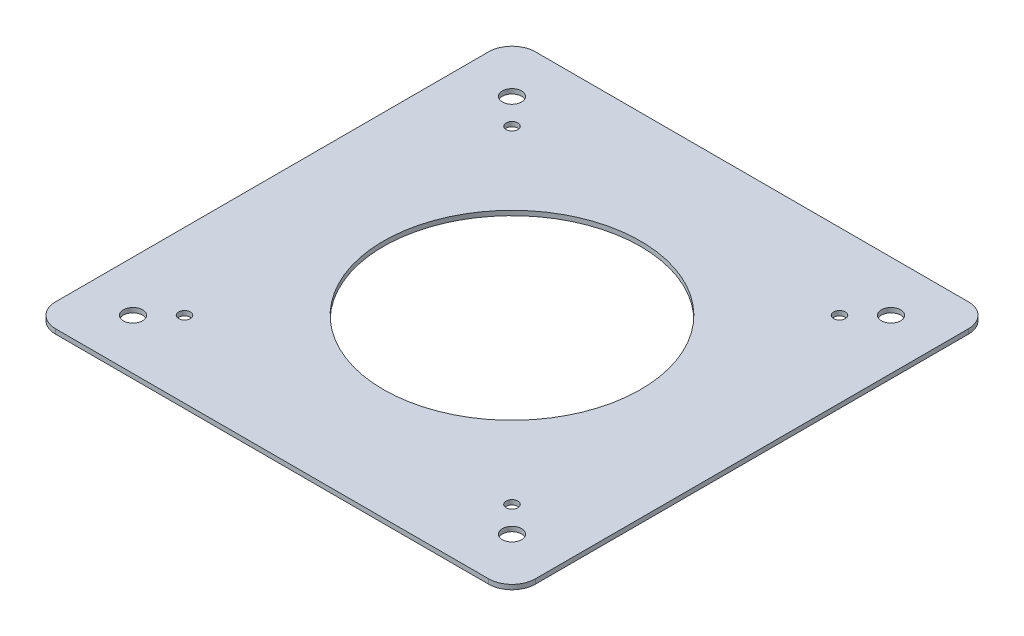
ISO-10303-21;
HEADER;
FILE_DESCRIPTION(('STEP AP214'),'2;1');
FILE_NAME('part.step','',(''),(''),'','','');
FILE_SCHEMA(('AUTOMOTIVE_DESIGN { 1 0 10303 214 1 1 1 1 }'));
ENDSEC;
DATA;
#1=APPLICATION_CONTEXT('core data for automotive mechanical design processes');
#2=APPLICATION_PROTOCOL_DEFINITION('international standard','automotive_design',2000,#1);
#3=PRODUCT_CONTEXT('',#1,'mechanical');
#4=PRODUCT('Part','Part','',(#3));
#5=PRODUCT_RELATED_PRODUCT_CATEGORY('part','',(#4));
#6=PRODUCT_DEFINITION_FORMATION('','',#4);
#7=PRODUCT_DEFINITION_CONTEXT('part definition',#1,'design');
#8=PRODUCT_DEFINITION('design','',#6,#7);
#9=PRODUCT_DEFINITION_SHAPE('','',#8);
#10=(LENGTH_UNIT() NAMED_UNIT(*) SI_UNIT(.MILLI.,.METRE.));
#11=(NAMED_UNIT(*) PLANE_ANGLE_UNIT() SI_UNIT($,.RADIAN.));
#12=(NAMED_UNIT(*) SI_UNIT($,.STERADIAN.) SOLID_ANGLE_UNIT());
#13=UNCERTAINTY_MEASURE_WITH_UNIT(LENGTH_MEASURE(1.E-05),#10,'distance_accuracy_value','');
#14=(GEOMETRIC_REPRESENTATION_CONTEXT(3) GLOBAL_UNCERTAINTY_ASSIGNED_CONTEXT((#13)) GLOBAL_UNIT_ASSIGNED_CONTEXT((#10,
#11,#12)) REPRESENTATION_CONTEXT('',''));
#15=CARTESIAN_POINT('',(0.,0.,0.));
#16=DIRECTION('',(0.,0.,1.));
#17=DIRECTION('',(1.,0.,0.));
#18=AXIS2_PLACEMENT_3D('',#15,#16,#17);
#19=CARTESIAN_POINT('',(-46.2,-1.,46.2));
#20=DIRECTION('',(0.,1.,0.));
#21=DIRECTION('',(0.,0.,1.));
#22=AXIS2_PLACEMENT_3D('',#19,#20,#21);
#23=CYLINDRICAL_SURFACE('',#22,5.);
#24=CARTESIAN_POINT('',(-46.2,0.,46.2));
#25=DIRECTION('',(0.,1.,0.));
#26=DIRECTION('',(0.,0.,-1.));
#27=AXIS2_PLACEMENT_3D('',#24,#25,#26);
#28=CIRCLE('',#27,5.);
#29=CARTESIAN_POINT('',(-51.2,0.,46.2));
#30=VERTEX_POINT('',#29);
#31=CARTESIAN_POINT('',(-46.1999999999999,0.,51.2));
#32=VERTEX_POINT('',#31);
#33=EDGE_CURVE('E133',#30,#32,#28,.T.);
#34=ORIENTED_EDGE('',*,*,#33,.F.);
#35=DIRECTION('',(0.,1.,0.));
#36=VECTOR('',#35,1.);
#37=CARTESIAN_POINT('',(-51.2,-1.,46.2));
#38=LINE('',#37,#36);
#39=CARTESIAN_POINT('',(-51.2,-1.,46.2));
#40=VERTEX_POINT('',#39);
#41=EDGE_CURVE('E11',#40,#30,#38,.T.);
#42=ORIENTED_EDGE('',*,*,#41,.F.);
#43=CARTESIAN_POINT('',(-46.2,-1.,46.2));
#44=DIRECTION('',(0.,1.,0.));
#45=DIRECTION('',(0.,0.,-1.));
#46=AXIS2_PLACEMENT_3D('',#43,#44,#45);
#47=CIRCLE('',#46,5.);
#48=CARTESIAN_POINT('',(-46.1999999999999,-1.,51.2));
#49=VERTEX_POINT('',#48);
#50=EDGE_CURVE('E154',#40,#49,#47,.T.);
#51=ORIENTED_EDGE('',*,*,#50,.T.);
#52=DIRECTION('',(0.,1.,0.));
#53=VECTOR('',#52,1.);
#54=CARTESIAN_POINT('',(-46.1999999999999,-1.,51.2));
#55=LINE('',#54,#53);
#56=EDGE_CURVE('E39',#49,#32,#55,.T.);
#57=ORIENTED_EDGE('',*,*,#56,.T.);
#58=EDGE_LOOP('',(#34,#42,#51,#57));
#59=FACE_BOUND('',#58,.T.);
#60=ADVANCED_FACE('F36',(#59),#23,.T.);
#61=CARTESIAN_POINT('',(-51.2,-1.,46.2));
#62=DIRECTION('',(-1.,0.,0.));
#63=DIRECTION('',(0.,0.,1.));
#64=AXIS2_PLACEMENT_3D('',#61,#62,#63);
#65=PLANE('',#64);
#66=DIRECTION('',(0.,0.,1.));
#67=VECTOR('',#66,1.);
#68=CARTESIAN_POINT('',(-51.2,0.,46.2));
#69=LINE('',#68,#67);
#70=CARTESIAN_POINT('',(-51.2,0.,-46.2));
#71=VERTEX_POINT('',#70);
#72=EDGE_CURVE('E152',#71,#30,#69,.T.);
#73=ORIENTED_EDGE('',*,*,#72,.F.);
#74=DIRECTION('',(0.,1.,0.));
#75=VECTOR('',#74,1.);
#76=CARTESIAN_POINT('',(-51.2,-1.,-46.2));
#77=LINE('',#76,#75);
#78=CARTESIAN_POINT('',(-51.2,-1.,-46.2));
#79=VERTEX_POINT('',#78);
#80=EDGE_CURVE('E45',#79,#71,#77,.T.);
#81=ORIENTED_EDGE('',*,*,#80,.F.);
#82=DIRECTION('',(0.,0.,1.));
#83=VECTOR('',#82,1.);
#84=CARTESIAN_POINT('',(-51.2,-1.,46.2));
#85=LINE('',#84,#83);
#86=EDGE_CURVE('E123',#79,#40,#85,.T.);
#87=ORIENTED_EDGE('',*,*,#86,.T.);
#88=ORIENTED_EDGE('',*,*,#41,.T.);
#89=EDGE_LOOP('',(#73,#81,#87,#88));
#90=FACE_BOUND('',#89,.T.);
#91=ADVANCED_FACE('F166',(#90),#65,.T.);
#92=CARTESIAN_POINT('',(-46.2,-1.,-46.2));
#93=DIRECTION('',(0.,1.,0.));
#94=DIRECTION('',(0.,0.,1.));
#95=AXIS2_PLACEMENT_3D('',#92,#93,#94);
#96=CYLINDRICAL_SURFACE('',#95,5.);
#97=CARTESIAN_POINT('',(-46.2,0.,-46.2));
#98=DIRECTION('',(0.,1.,0.));
#99=DIRECTION('',(0.,0.,-1.));
#100=AXIS2_PLACEMENT_3D('',#97,#98,#99);
#101=CIRCLE('',#100,5.);
#102=CARTESIAN_POINT('',(-46.1999999999999,0.,-51.2));
#103=VERTEX_POINT('',#102);
#104=EDGE_CURVE('E110',#103,#71,#101,.T.);
#105=ORIENTED_EDGE('',*,*,#104,.F.);
#106=DIRECTION('',(0.,1.,0.));
#107=VECTOR('',#106,1.);
#108=CARTESIAN_POINT('',(-46.1999999999999,-1.,-51.2));
#109=LINE('',#108,#107);
#110=CARTESIAN_POINT('',(-46.1999999999999,-1.,-51.2));
#111=VERTEX_POINT('',#110);
#112=EDGE_CURVE('E105',#111,#103,#109,.T.);
#113=ORIENTED_EDGE('',*,*,#112,.F.);
#114=CARTESIAN_POINT('',(-46.2,-1.,-46.2));
#115=DIRECTION('',(0.,1.,0.));
#116=DIRECTION('',(0.,0.,-1.));
#117=AXIS2_PLACEMENT_3D('',#114,#115,#116);
#118=CIRCLE('',#117,5.);
#119=EDGE_CURVE('E108',#111,#79,#118,.T.);
#120=ORIENTED_EDGE('',*,*,#119,.T.);
#121=ORIENTED_EDGE('',*,*,#80,.T.);
#122=EDGE_LOOP('',(#105,#113,#120,#121));
#123=FACE_BOUND('',#122,.T.);
#124=ADVANCED_FACE('F107',(#123),#96,.T.);
#125=CARTESIAN_POINT('',(-46.1999999999999,-1.,-51.2));
#126=DIRECTION('',(0.,0.,-1.));
#127=DIRECTION('',(-1.,0.,0.));
#128=AXIS2_PLACEMENT_3D('',#125,#126,#127);
#129=PLANE('',#128);
#130=DIRECTION('',(-1.,0.,0.));
#131=VECTOR('',#130,1.);
#132=CARTESIAN_POINT('',(-46.1999999999999,0.,-51.2));
#133=LINE('',#132,#131);
#134=CARTESIAN_POINT('',(46.2,0.,-51.2));
#135=VERTEX_POINT('',#134);
#136=EDGE_CURVE('E149',#135,#103,#133,.T.);
#137=ORIENTED_EDGE('',*,*,#136,.F.);
#138=DIRECTION('',(0.,1.,0.));
#139=VECTOR('',#138,1.);
#140=CARTESIAN_POINT('',(46.2,-1.,-51.2));
#141=LINE('',#140,#139);
#142=CARTESIAN_POINT('',(46.2,-1.,-51.2));
#143=VERTEX_POINT('',#142);
#144=EDGE_CURVE('E115',#143,#135,#141,.T.);
#145=ORIENTED_EDGE('',*,*,#144,.F.);
#146=DIRECTION('',(-1.,0.,0.));
#147=VECTOR('',#146,1.);
#148=CARTESIAN_POINT('',(-46.1999999999999,-1.,-51.2));
#149=LINE('',#148,#147);
#150=EDGE_CURVE('E121',#143,#111,#149,.T.);
#151=ORIENTED_EDGE('',*,*,#150,.T.);
#152=ORIENTED_EDGE('',*,*,#112,.T.);
#153=EDGE_LOOP('',(#137,#145,#151,#152));
#154=FACE_BOUND('',#153,.T.);
#155=ADVANCED_FACE('F125',(#154),#129,.T.);
#156=CARTESIAN_POINT('',(46.2,-1.,-46.2));
#157=DIRECTION('',(0.,1.,0.));
#158=DIRECTION('',(0.,0.,1.));
#159=AXIS2_PLACEMENT_3D('',#156,#157,#158);
#160=CYLINDRICAL_SURFACE('',#159,5.);
#161=CARTESIAN_POINT('',(46.2,0.,-46.2));
#162=DIRECTION('',(0.,1.,0.));
#163=DIRECTION('',(0.,0.,-1.));
#164=AXIS2_PLACEMENT_3D('',#161,#162,#163);
#165=CIRCLE('',#164,5.);
#166=CARTESIAN_POINT('',(51.2,0.,-46.2));
#167=VERTEX_POINT('',#166);
#168=EDGE_CURVE('E146',#167,#135,#165,.T.);
#169=ORIENTED_EDGE('',*,*,#168,.F.);
#170=DIRECTION('',(0.,1.,0.));
#171=VECTOR('',#170,1.);
#172=CARTESIAN_POINT('',(51.2,-1.,-46.2));
#173=LINE('',#172,#171);
#174=CARTESIAN_POINT('',(51.2,-1.,-46.2));
#175=VERTEX_POINT('',#174);
#176=EDGE_CURVE('E158',#175,#167,#173,.T.);
#177=ORIENTED_EDGE('',*,*,#176,.F.);
#178=CARTESIAN_POINT('',(46.2,-1.,-46.2));
#179=DIRECTION('',(0.,1.,0.));
#180=DIRECTION('',(0.,0.,-1.));
#181=AXIS2_PLACEMENT_3D('',#178,#179,#180);
#182=CIRCLE('',#181,5.);
#183=EDGE_CURVE('E126',#175,#143,#182,.T.);
#184=ORIENTED_EDGE('',*,*,#183,.T.);
#185=ORIENTED_EDGE('',*,*,#144,.T.);
#186=EDGE_LOOP('',(#169,#177,#184,#185));
#187=FACE_BOUND('',#186,.T.);
#188=ADVANCED_FACE('F179',(#187),#160,.T.);
#189=CARTESIAN_POINT('',(51.2,-1.,46.2));
#190=DIRECTION('',(1.,0.,0.));
#191=DIRECTION('',(0.,0.,-1.));
#192=AXIS2_PLACEMENT_3D('',#189,#190,#191);
#193=PLANE('',#192);
#194=DIRECTION('',(0.,0.,-1.));
#195=VECTOR('',#194,1.);
#196=CARTESIAN_POINT('',(51.2,0.,46.2));
#197=LINE('',#196,#195);
#198=CARTESIAN_POINT('',(51.2,0.,46.2));
#199=VERTEX_POINT('',#198);
#200=EDGE_CURVE('E143',#199,#167,#197,.T.);
#201=ORIENTED_EDGE('',*,*,#200,.F.);
#202=DIRECTION('',(0.,1.,0.));
#203=VECTOR('',#202,1.);
#204=CARTESIAN_POINT('',(51.2,-1.,46.2));
#205=LINE('',#204,#203);
#206=CARTESIAN_POINT('',(51.2,-1.,46.2));
#207=VERTEX_POINT('',#206);
#208=EDGE_CURVE('E160',#207,#199,#205,.T.);
#209=ORIENTED_EDGE('',*,*,#208,.F.);
#210=DIRECTION('',(0.,0.,-1.));
#211=VECTOR('',#210,1.);
#212=CARTESIAN_POINT('',(51.2,-1.,46.2));
#213=LINE('',#212,#211);
#214=EDGE_CURVE('E128',#207,#175,#213,.T.);
#215=ORIENTED_EDGE('',*,*,#214,.T.);
#216=ORIENTED_EDGE('',*,*,#176,.T.);
#217=EDGE_LOOP('',(#201,#209,#215,#216));
#218=FACE_BOUND('',#217,.T.);
#219=ADVANCED_FACE('F182',(#218),#193,.T.);
#220=CARTESIAN_POINT('',(46.2,-1.,46.2));
#221=DIRECTION('',(0.,1.,0.));
#222=DIRECTION('',(0.,0.,1.));
#223=AXIS2_PLACEMENT_3D('',#220,#221,#222);
#224=CYLINDRICAL_SURFACE('',#223,5.);
#225=CARTESIAN_POINT('',(46.2,0.,46.2));
#226=DIRECTION('',(0.,1.,0.));
#227=DIRECTION('',(0.,0.,1.));
#228=AXIS2_PLACEMENT_3D('',#225,#226,#227);
#229=CIRCLE('',#228,5.);
#230=CARTESIAN_POINT('',(46.2,0.,51.2));
#231=VERTEX_POINT('',#230);
#232=EDGE_CURVE('E140',#231,#199,#229,.T.);
#233=ORIENTED_EDGE('',*,*,#232,.F.);
#234=DIRECTION('',(0.,1.,0.));
#235=VECTOR('',#234,1.);
#236=CARTESIAN_POINT('',(46.2,-1.,51.2));
#237=LINE('',#236,#235);
#238=CARTESIAN_POINT('',(46.2,-1.,51.2));
#239=VERTEX_POINT('',#238);
#240=EDGE_CURVE('E161',#239,#231,#237,.T.);
#241=ORIENTED_EDGE('',*,*,#240,.F.);
#242=CARTESIAN_POINT('',(46.2,-1.,46.2));
#243=DIRECTION('',(0.,1.,0.));
#244=DIRECTION('',(0.,0.,1.));
#245=AXIS2_PLACEMENT_3D('',#242,#243,#244);
#246=CIRCLE('',#245,5.);
#247=EDGE_CURVE('E299',#239,#207,#246,.T.);
#248=ORIENTED_EDGE('',*,*,#247,.T.);
#249=ORIENTED_EDGE('',*,*,#208,.T.);
#250=EDGE_LOOP('',(#233,#241,#248,#249));
#251=FACE_BOUND('',#250,.T.);
#252=ADVANCED_FACE('F186',(#251),#224,.T.);
#253=CARTESIAN_POINT('',(-46.1999999999999,-1.,51.2));
#254=DIRECTION('',(0.,0.,1.));
#255=DIRECTION('',(1.,0.,0.));
#256=AXIS2_PLACEMENT_3D('',#253,#254,#255);
#257=PLANE('',#256);
#258=DIRECTION('',(1.,0.,0.));
#259=VECTOR('',#258,1.);
#260=CARTESIAN_POINT('',(-46.1999999999999,0.,51.2));
#261=LINE('',#260,#259);
#262=EDGE_CURVE('E136',#32,#231,#261,.T.);
#263=ORIENTED_EDGE('',*,*,#262,.F.);
#264=ORIENTED_EDGE('',*,*,#56,.F.);
#265=DIRECTION('',(1.,0.,0.));
#266=VECTOR('',#265,1.);
#267=CARTESIAN_POINT('',(-46.1999999999999,-1.,51.2));
#268=LINE('',#267,#266);
#269=EDGE_CURVE('E297',#49,#239,#268,.T.);
#270=ORIENTED_EDGE('',*,*,#269,.T.);
#271=ORIENTED_EDGE('',*,*,#240,.T.);
#272=EDGE_LOOP('',(#263,#264,#270,#271));
#273=FACE_BOUND('',#272,.T.);
#274=ADVANCED_FACE('F163',(#273),#257,.T.);
#275=CARTESIAN_POINT('',(-46.2,-1.,46.2));
#276=DIRECTION('',(0.,-1.,0.));
#277=DIRECTION('',(0.,0.,-1.));
#278=AXIS2_PLACEMENT_3D('',#275,#276,#277);
#279=PLANE('',#278);
#280=CARTESIAN_POINT('',(34.9500000000004,-0.999999999999999,34.9499999999997));
#281=DIRECTION('',(0.,-1.,0.));
#282=DIRECTION('',(0.,0.,-1.));
#283=AXIS2_PLACEMENT_3D('',#280,#281,#282);
#284=CIRCLE('',#283,1.25);
#285=CARTESIAN_POINT('',(34.9500000000004,-0.999999999999999,33.6999999999997));
#286=VERTEX_POINT('',#285);
#287=EDGE_CURVE('E242',#286,#286,#284,.T.);
#288=ORIENTED_EDGE('',*,*,#287,.F.);
#289=EDGE_LOOP('',(#288));
#290=FACE_BOUND('',#289,.T.);
#291=CARTESIAN_POINT('',(40.4500000000004,-0.999999999999999,40.4499999999996));
#292=DIRECTION('',(0.,-1.,0.));
#293=DIRECTION('',(0.,0.,-1.));
#294=AXIS2_PLACEMENT_3D('',#291,#292,#293);
#295=CIRCLE('',#294,2.04999999999999);
#296=CARTESIAN_POINT('',(40.4500000000004,-0.999999999999999,38.3999999999996));
#297=VERTEX_POINT('',#296);
#298=EDGE_CURVE('E252',#297,#297,#295,.T.);
#299=ORIENTED_EDGE('',*,*,#298,.F.);
#300=EDGE_LOOP('',(#299));
#301=FACE_BOUND('',#300,.T.);
#302=CARTESIAN_POINT('',(-34.95,-0.999999999999999,34.95));
#303=DIRECTION('',(0.,-1.,0.));
#304=DIRECTION('',(0.,0.,-1.));
#305=AXIS2_PLACEMENT_3D('',#302,#303,#304);
#306=CIRCLE('',#305,1.25);
#307=CARTESIAN_POINT('',(-34.95,-0.999999999999999,33.7));
#308=VERTEX_POINT('',#307);
#309=EDGE_CURVE('E258',#308,#308,#306,.T.);
#310=ORIENTED_EDGE('',*,*,#309,.F.);
#311=EDGE_LOOP('',(#310));
#312=FACE_BOUND('',#311,.T.);
#313=CARTESIAN_POINT('',(-40.45,-0.999999999999999,40.45));
#314=DIRECTION('',(0.,-1.,0.));
#315=DIRECTION('',(0.,0.,-1.));
#316=AXIS2_PLACEMENT_3D('',#313,#314,#315);
#317=CIRCLE('',#316,2.04999999999999);
#318=CARTESIAN_POINT('',(-40.45,-0.999999999999999,38.4));
#319=VERTEX_POINT('',#318);
#320=EDGE_CURVE('E264',#319,#319,#317,.T.);
#321=ORIENTED_EDGE('',*,*,#320,.F.);
#322=EDGE_LOOP('',(#321));
#323=FACE_BOUND('',#322,.T.);
#324=CARTESIAN_POINT('',(-34.9500000000001,-0.999999999999999,-34.9499999999999));
#325=DIRECTION('',(0.,-1.,0.));
#326=DIRECTION('',(0.,0.,-1.));
#327=AXIS2_PLACEMENT_3D('',#324,#325,#326);
#328=CIRCLE('',#327,1.25);
#329=CARTESIAN_POINT('',(-34.9500000000001,-0.999999999999999,-36.1999999999999));
#330=VERTEX_POINT('',#329);
#331=EDGE_CURVE('E270',#330,#330,#328,.T.);
#332=ORIENTED_EDGE('',*,*,#331,.F.);
#333=EDGE_LOOP('',(#332));
#334=FACE_BOUND('',#333,.T.);
#335=CARTESIAN_POINT('',(-40.4500000000002,-0.999999999999999,-40.4499999999999));
#336=DIRECTION('',(0.,-1.,0.));
#337=DIRECTION('',(0.,0.,-1.));
#338=AXIS2_PLACEMENT_3D('',#335,#336,#337);
#339=CIRCLE('',#338,2.04999999999999);
#340=CARTESIAN_POINT('',(-40.4500000000002,-0.999999999999999,-42.4999999999999));
#341=VERTEX_POINT('',#340);
#342=EDGE_CURVE('E276',#341,#341,#339,.T.);
#343=ORIENTED_EDGE('',*,*,#342,.F.);
#344=EDGE_LOOP('',(#343));
#345=FACE_BOUND('',#344,.T.);
#346=CARTESIAN_POINT('',(34.95,-0.999999999999999,-34.95));
#347=DIRECTION('',(0.,-1.,0.));
#348=DIRECTION('',(0.,0.,-1.));
#349=AXIS2_PLACEMENT_3D('',#346,#347,#348);
#350=CIRCLE('',#349,1.25);
#351=CARTESIAN_POINT('',(34.95,-0.999999999999999,-36.2));
#352=VERTEX_POINT('',#351);
#353=EDGE_CURVE('E282',#352,#352,#350,.T.);
#354=ORIENTED_EDGE('',*,*,#353,.F.);
#355=EDGE_LOOP('',(#354));
#356=FACE_BOUND('',#355,.T.);
#357=CARTESIAN_POINT('',(40.45,-0.999999999999999,-40.45));
#358=DIRECTION('',(0.,-1.,0.));
#359=DIRECTION('',(0.,0.,-1.));
#360=AXIS2_PLACEMENT_3D('',#357,#358,#359);
#361=CIRCLE('',#360,2.04999999999999);
#362=CARTESIAN_POINT('',(40.45,-0.999999999999999,-42.5));
#363=VERTEX_POINT('',#362);
#364=EDGE_CURVE('E288',#363,#363,#361,.T.);
#365=ORIENTED_EDGE('',*,*,#364,.F.);
#366=EDGE_LOOP('',(#365));
#367=FACE_BOUND('',#366,.T.);
#368=CARTESIAN_POINT('',(0.,-0.999999999999999,0.));
#369=DIRECTION('',(0.,-1.,0.));
#370=DIRECTION('',(0.,0.,-1.));
#371=AXIS2_PLACEMENT_3D('',#368,#369,#370);
#372=CIRCLE('',#371,27.45);
#373=CARTESIAN_POINT('',(0.,-0.999999999999999,-27.45));
#374=VERTEX_POINT('',#373);
#375=EDGE_CURVE('E137',#374,#374,#372,.T.);
#376=ORIENTED_EDGE('',*,*,#375,.F.);
#377=EDGE_LOOP('',(#376));
#378=FACE_BOUND('',#377,.T.);
#379=ORIENTED_EDGE('',*,*,#50,.F.);
#380=ORIENTED_EDGE('',*,*,#86,.F.);
#381=ORIENTED_EDGE('',*,*,#119,.F.);
#382=ORIENTED_EDGE('',*,*,#150,.F.);
#383=ORIENTED_EDGE('',*,*,#183,.F.);
#384=ORIENTED_EDGE('',*,*,#214,.F.);
#385=ORIENTED_EDGE('',*,*,#247,.F.);
#386=ORIENTED_EDGE('',*,*,#269,.F.);
#387=EDGE_LOOP('',(#379,#380,#381,#382,#383,#384,#385,#386));
#388=FACE_BOUND('',#387,.T.);
#389=ADVANCED_FACE('F119',(#290,#301,#312,#323,#334,#345,#356,#367,#378,#388),#279,.T.);
#390=CARTESIAN_POINT('',(-46.2,0.,46.2));
#391=DIRECTION('',(0.,-1.,0.));
#392=DIRECTION('',(0.,0.,-1.));
#393=AXIS2_PLACEMENT_3D('',#390,#391,#392);
#394=PLANE('',#393);
#395=CARTESIAN_POINT('',(34.9500000000004,0.,34.9499999999997));
#396=DIRECTION('',(0.,1.,0.));
#397=DIRECTION('',(-1.,0.,0.));
#398=AXIS2_PLACEMENT_3D('',#395,#396,#397);
#399=CIRCLE('',#398,1.25);
#400=CARTESIAN_POINT('',(33.7000000000004,0.,34.9499999999997));
#401=VERTEX_POINT('',#400);
#402=EDGE_CURVE('E245',#401,#401,#399,.T.);
#403=ORIENTED_EDGE('',*,*,#402,.F.);
#404=EDGE_LOOP('',(#403));
#405=FACE_BOUND('',#404,.T.);
#406=CARTESIAN_POINT('',(40.4500000000004,0.,40.4499999999996));
#407=DIRECTION('',(0.,1.,0.));
#408=DIRECTION('',(-1.,0.,0.));
#409=AXIS2_PLACEMENT_3D('',#406,#407,#408);
#410=CIRCLE('',#409,2.04999999999999);
#411=CARTESIAN_POINT('',(38.4000000000004,0.,40.4499999999996));
#412=VERTEX_POINT('',#411);
#413=EDGE_CURVE('E247',#412,#412,#410,.T.);
#414=ORIENTED_EDGE('',*,*,#413,.F.);
#415=EDGE_LOOP('',(#414));
#416=FACE_BOUND('',#415,.T.);
#417=CARTESIAN_POINT('',(-34.95,0.,34.95));
#418=DIRECTION('',(0.,1.,0.));
#419=DIRECTION('',(0.,0.,-1.));
#420=AXIS2_PLACEMENT_3D('',#417,#418,#419);
#421=CIRCLE('',#420,1.25);
#422=CARTESIAN_POINT('',(-34.95,0.,33.7));
#423=VERTEX_POINT('',#422);
#424=EDGE_CURVE('E255',#423,#423,#421,.T.);
#425=ORIENTED_EDGE('',*,*,#424,.F.);
#426=EDGE_LOOP('',(#425));
#427=FACE_BOUND('',#426,.T.);
#428=CARTESIAN_POINT('',(-40.45,0.,40.45));
#429=DIRECTION('',(0.,1.,0.));
#430=DIRECTION('',(0.,0.,-1.));
#431=AXIS2_PLACEMENT_3D('',#428,#429,#430);
#432=CIRCLE('',#431,2.04999999999999);
#433=CARTESIAN_POINT('',(-40.45,0.,38.4));
#434=VERTEX_POINT('',#433);
#435=EDGE_CURVE('E261',#434,#434,#432,.T.);
#436=ORIENTED_EDGE('',*,*,#435,.F.);
#437=EDGE_LOOP('',(#436));
#438=FACE_BOUND('',#437,.T.);
#439=CARTESIAN_POINT('',(-34.9500000000001,0.,-34.9499999999999));
#440=DIRECTION('',(0.,1.,0.));
#441=DIRECTION('',(1.,0.,0.));
#442=AXIS2_PLACEMENT_3D('',#439,#440,#441);
#443=CIRCLE('',#442,1.25);
#444=CARTESIAN_POINT('',(-33.7000000000001,0.,-34.9499999999999));
#445=VERTEX_POINT('',#444);
#446=EDGE_CURVE('E267',#445,#445,#443,.T.);
#447=ORIENTED_EDGE('',*,*,#446,.F.);
#448=EDGE_LOOP('',(#447));
#449=FACE_BOUND('',#448,.T.);
#450=CARTESIAN_POINT('',(-40.4500000000002,0.,-40.4499999999999));
#451=DIRECTION('',(0.,1.,0.));
#452=DIRECTION('',(1.,0.,0.));
#453=AXIS2_PLACEMENT_3D('',#450,#451,#452);
#454=CIRCLE('',#453,2.04999999999999);
#455=CARTESIAN_POINT('',(-38.4000000000002,0.,-40.4499999999999));
#456=VERTEX_POINT('',#455);
#457=EDGE_CURVE('E273',#456,#456,#454,.T.);
#458=ORIENTED_EDGE('',*,*,#457,.F.);
#459=EDGE_LOOP('',(#458));
#460=FACE_BOUND('',#459,.T.);
#461=CARTESIAN_POINT('',(34.95,0.,-34.95));
#462=DIRECTION('',(0.,1.,0.));
#463=DIRECTION('',(0.,0.,1.));
#464=AXIS2_PLACEMENT_3D('',#461,#462,#463);
#465=CIRCLE('',#464,1.25);
#466=CARTESIAN_POINT('',(34.95,0.,-33.7));
#467=VERTEX_POINT('',#466);
#468=EDGE_CURVE('E279',#467,#467,#465,.T.);
#469=ORIENTED_EDGE('',*,*,#468,.F.);
#470=EDGE_LOOP('',(#469));
#471=FACE_BOUND('',#470,.T.);
#472=CARTESIAN_POINT('',(40.45,0.,-40.45));
#473=DIRECTION('',(0.,1.,0.));
#474=DIRECTION('',(0.,0.,1.));
#475=AXIS2_PLACEMENT_3D('',#472,#473,#474);
#476=CIRCLE('',#475,2.04999999999999);
#477=CARTESIAN_POINT('',(40.45,0.,-38.4));
#478=VERTEX_POINT('',#477);
#479=EDGE_CURVE('E285',#478,#478,#476,.T.);
#480=ORIENTED_EDGE('',*,*,#479,.F.);
#481=EDGE_LOOP('',(#480));
#482=FACE_BOUND('',#481,.T.);
#483=CARTESIAN_POINT('',(0.,0.,0.));
#484=DIRECTION('',(0.,1.,0.));
#485=DIRECTION('',(0.,0.,1.));
#486=AXIS2_PLACEMENT_3D('',#483,#484,#485);
#487=CIRCLE('',#486,27.45);
#488=CARTESIAN_POINT('',(0.,0.,27.45));
#489=VERTEX_POINT('',#488);
#490=EDGE_CURVE('E291',#489,#489,#487,.T.);
#491=ORIENTED_EDGE('',*,*,#490,.F.);
#492=EDGE_LOOP('',(#491));
#493=FACE_BOUND('',#492,.T.);
#494=ORIENTED_EDGE('',*,*,#33,.T.);
#495=ORIENTED_EDGE('',*,*,#262,.T.);
#496=ORIENTED_EDGE('',*,*,#232,.T.);
#497=ORIENTED_EDGE('',*,*,#200,.T.);
#498=ORIENTED_EDGE('',*,*,#168,.T.);
#499=ORIENTED_EDGE('',*,*,#136,.T.);
#500=ORIENTED_EDGE('',*,*,#104,.T.);
#501=ORIENTED_EDGE('',*,*,#72,.T.);
#502=EDGE_LOOP('',(#494,#495,#496,#497,#498,#499,#500,#501));
#503=FACE_BOUND('',#502,.T.);
#504=ADVANCED_FACE('F165',(#405,#416,#427,#438,#449,#460,#471,#482,#493,#503),#394,.F.);
#505=CARTESIAN_POINT('',(0.,-10.,0.));
#506=DIRECTION('',(0.,1.,0.));
#507=DIRECTION('',(0.,0.,1.));
#508=AXIS2_PLACEMENT_3D('',#505,#506,#507);
#509=CYLINDRICAL_SURFACE('',#508,27.45);
#510=ORIENTED_EDGE('',*,*,#375,.T.);
#511=EDGE_LOOP('',(#510));
#512=FACE_BOUND('',#511,.T.);
#513=ORIENTED_EDGE('',*,*,#490,.T.);
#514=EDGE_LOOP('',(#513));
#515=FACE_BOUND('',#514,.T.);
#516=ADVANCED_FACE('F199',(#512,#515),#509,.F.);
#517=CARTESIAN_POINT('',(40.45,-10.,-40.45));
#518=DIRECTION('',(0.,1.,0.));
#519=DIRECTION('',(0.,0.,1.));
#520=AXIS2_PLACEMENT_3D('',#517,#518,#519);
#521=CYLINDRICAL_SURFACE('',#520,2.04999999999999);
#522=ORIENTED_EDGE('',*,*,#364,.T.);
#523=EDGE_LOOP('',(#522));
#524=FACE_BOUND('',#523,.T.);
#525=ORIENTED_EDGE('',*,*,#479,.T.);
#526=EDGE_LOOP('',(#525));
#527=FACE_BOUND('',#526,.T.);
#528=ADVANCED_FACE('F206',(#524,#527),#521,.F.);
#529=CARTESIAN_POINT('',(34.95,-10.,-34.95));
#530=DIRECTION('',(0.,1.,0.));
#531=DIRECTION('',(0.,0.,1.));
#532=AXIS2_PLACEMENT_3D('',#529,#530,#531);
#533=CYLINDRICAL_SURFACE('',#532,1.25);
#534=ORIENTED_EDGE('',*,*,#353,.T.);
#535=EDGE_LOOP('',(#534));
#536=FACE_BOUND('',#535,.T.);
#537=ORIENTED_EDGE('',*,*,#468,.T.);
#538=EDGE_LOOP('',(#537));
#539=FACE_BOUND('',#538,.T.);
#540=ADVANCED_FACE('F210',(#536,#539),#533,.F.);
#541=CARTESIAN_POINT('',(-40.4500000000002,-10.,-40.4499999999999));
#542=DIRECTION('',(0.,1.,0.));
#543=DIRECTION('',(0.,0.,1.));
#544=AXIS2_PLACEMENT_3D('',#541,#542,#543);
#545=CYLINDRICAL_SURFACE('',#544,2.04999999999999);
#546=ORIENTED_EDGE('',*,*,#342,.T.);
#547=EDGE_LOOP('',(#546));
#548=FACE_BOUND('',#547,.T.);
#549=ORIENTED_EDGE('',*,*,#457,.T.);
#550=EDGE_LOOP('',(#549));
#551=FACE_BOUND('',#550,.T.);
#552=ADVANCED_FACE('F214',(#548,#551),#545,.F.);
#553=CARTESIAN_POINT('',(-34.9500000000001,-10.,-34.9499999999999));
#554=DIRECTION('',(0.,1.,0.));
#555=DIRECTION('',(0.,0.,1.));
#556=AXIS2_PLACEMENT_3D('',#553,#554,#555);
#557=CYLINDRICAL_SURFACE('',#556,1.25);
#558=ORIENTED_EDGE('',*,*,#331,.T.);
#559=EDGE_LOOP('',(#558));
#560=FACE_BOUND('',#559,.T.);
#561=ORIENTED_EDGE('',*,*,#446,.T.);
#562=EDGE_LOOP('',(#561));
#563=FACE_BOUND('',#562,.T.);
#564=ADVANCED_FACE('F218',(#560,#563),#557,.F.);
#565=CARTESIAN_POINT('',(-40.45,-10.,40.45));
#566=DIRECTION('',(0.,1.,0.));
#567=DIRECTION('',(0.,0.,1.));
#568=AXIS2_PLACEMENT_3D('',#565,#566,#567);
#569=CYLINDRICAL_SURFACE('',#568,2.04999999999999);
#570=ORIENTED_EDGE('',*,*,#320,.T.);
#571=EDGE_LOOP('',(#570));
#572=FACE_BOUND('',#571,.T.);
#573=ORIENTED_EDGE('',*,*,#435,.T.);
#574=EDGE_LOOP('',(#573));
#575=FACE_BOUND('',#574,.T.);
#576=ADVANCED_FACE('F222',(#572,#575),#569,.F.);
#577=CARTESIAN_POINT('',(-34.95,-10.,34.95));
#578=DIRECTION('',(0.,1.,0.));
#579=DIRECTION('',(0.,0.,1.));
#580=AXIS2_PLACEMENT_3D('',#577,#578,#579);
#581=CYLINDRICAL_SURFACE('',#580,1.25);
#582=ORIENTED_EDGE('',*,*,#309,.T.);
#583=EDGE_LOOP('',(#582));
#584=FACE_BOUND('',#583,.T.);
#585=ORIENTED_EDGE('',*,*,#424,.T.);
#586=EDGE_LOOP('',(#585));
#587=FACE_BOUND('',#586,.T.);
#588=ADVANCED_FACE('F226',(#584,#587),#581,.F.);
#589=CARTESIAN_POINT('',(40.4500000000004,-10.,40.4499999999996));
#590=DIRECTION('',(0.,1.,0.));
#591=DIRECTION('',(0.,0.,1.));
#592=AXIS2_PLACEMENT_3D('',#589,#590,#591);
#593=CYLINDRICAL_SURFACE('',#592,2.04999999999999);
#594=ORIENTED_EDGE('',*,*,#298,.T.);
#595=EDGE_LOOP('',(#594));
#596=FACE_BOUND('',#595,.T.);
#597=ORIENTED_EDGE('',*,*,#413,.T.);
#598=EDGE_LOOP('',(#597));
#599=FACE_BOUND('',#598,.T.);
#600=ADVANCED_FACE('F230',(#596,#599),#593,.F.);
#601=CARTESIAN_POINT('',(34.9500000000004,-10.,34.9499999999997));
#602=DIRECTION('',(0.,1.,0.));
#603=DIRECTION('',(0.,0.,1.));
#604=AXIS2_PLACEMENT_3D('',#601,#602,#603);
#605=CYLINDRICAL_SURFACE('',#604,1.25);
#606=ORIENTED_EDGE('',*,*,#287,.T.);
#607=EDGE_LOOP('',(#606));
#608=FACE_BOUND('',#607,.T.);
#609=ORIENTED_EDGE('',*,*,#402,.T.);
#610=EDGE_LOOP('',(#609));
#611=FACE_BOUND('',#610,.T.);
#612=ADVANCED_FACE('F234',(#608,#611),#605,.F.);
#613=CLOSED_SHELL('',(#60,#91,#124,#155,#188,#219,#252,#274,#389,#504,#516,#528,#540,#552,#564,
#576,#588,#600,#612));
#614=MANIFOLD_SOLID_BREP('B2',#613);
#615=ADVANCED_BREP_SHAPE_REPRESENTATION('',(#18,#614),#14);
#616=SHAPE_DEFINITION_REPRESENTATION(#9,#615);
ENDSEC;
END-ISO-10303-21;
